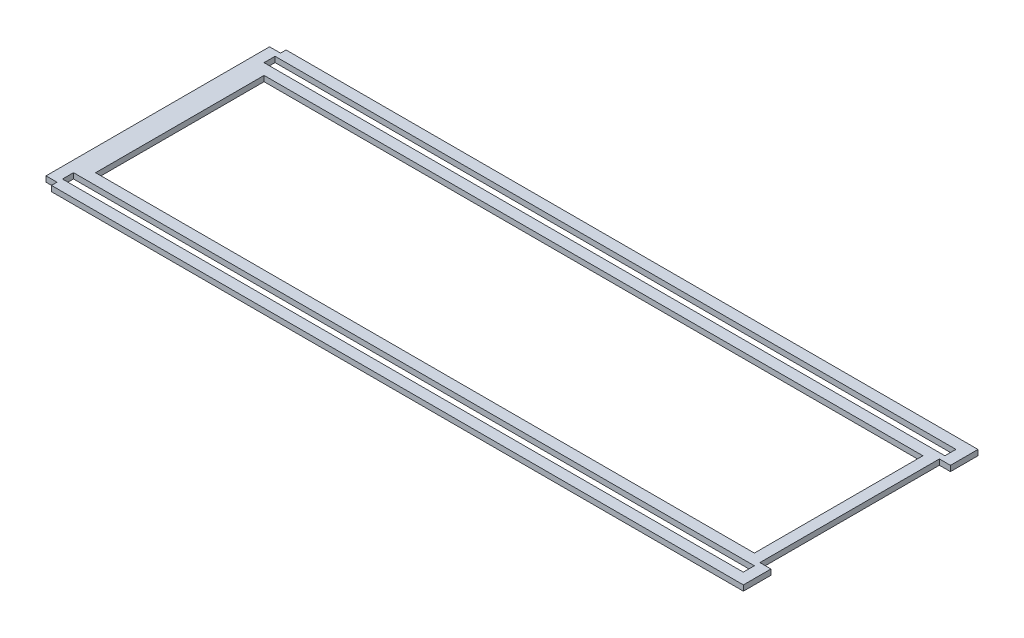
ISO-10303-21;
HEADER;
FILE_DESCRIPTION(('STEP AP214'),'2;1');
FILE_NAME('part.step','',(''),(''),'','','');
FILE_SCHEMA(('AUTOMOTIVE_DESIGN { 1 0 10303 214 1 1 1 1 }'));
ENDSEC;
DATA;
#1=APPLICATION_CONTEXT('core data for automotive mechanical design processes');
#2=APPLICATION_PROTOCOL_DEFINITION('international standard','automotive_design',2000,#1);
#3=PRODUCT_CONTEXT('',#1,'mechanical');
#4=PRODUCT('Part','Part','',(#3));
#5=PRODUCT_RELATED_PRODUCT_CATEGORY('part','',(#4));
#6=PRODUCT_DEFINITION_FORMATION('','',#4);
#7=PRODUCT_DEFINITION_CONTEXT('part definition',#1,'design');
#8=PRODUCT_DEFINITION('design','',#6,#7);
#9=PRODUCT_DEFINITION_SHAPE('','',#8);
#10=(LENGTH_UNIT() NAMED_UNIT(*) SI_UNIT(.MILLI.,.METRE.));
#11=(NAMED_UNIT(*) PLANE_ANGLE_UNIT() SI_UNIT($,.RADIAN.));
#12=(NAMED_UNIT(*) SI_UNIT($,.STERADIAN.) SOLID_ANGLE_UNIT());
#13=UNCERTAINTY_MEASURE_WITH_UNIT(LENGTH_MEASURE(1.E-05),#10,'distance_accuracy_value','');
#14=(GEOMETRIC_REPRESENTATION_CONTEXT(3) GLOBAL_UNCERTAINTY_ASSIGNED_CONTEXT((#13)) GLOBAL_UNIT_ASSIGNED_CONTEXT((#10,
#11,#12)) REPRESENTATION_CONTEXT('',''));
#15=CARTESIAN_POINT('',(0.,0.,0.));
#16=DIRECTION('',(0.,0.,1.));
#17=DIRECTION('',(1.,0.,0.));
#18=AXIS2_PLACEMENT_3D('',#15,#16,#17);
#19=CARTESIAN_POINT('',(0.,3.175,0.));
#20=DIRECTION('',(0.,1.,0.));
#21=DIRECTION('',(0.,0.,1.));
#22=AXIS2_PLACEMENT_3D('',#19,#20,#21);
#23=PLANE('',#22);
#24=DIRECTION('',(0.,0.,-1.));
#25=VECTOR('',#24,1.);
#26=CARTESIAN_POINT('',(203.2,3.175,51.895375));
#27=LINE('',#26,#25);
#28=CARTESIAN_POINT('',(203.2,3.175,67.821175));
#29=VERTEX_POINT('',#28);
#30=CARTESIAN_POINT('',(203.2,3.175,51.895375));
#31=VERTEX_POINT('',#30);
#32=EDGE_CURVE('E335',#29,#31,#27,.T.);
#33=ORIENTED_EDGE('',*,*,#32,.T.);
#34=DIRECTION('',(-1.,0.,0.));
#35=VECTOR('',#34,1.);
#36=CARTESIAN_POINT('',(203.2,3.175,51.895375));
#37=LINE('',#36,#35);
#38=CARTESIAN_POINT('',(196.7992,3.175,51.895375));
#39=VERTEX_POINT('',#38);
#40=EDGE_CURVE('E339',#31,#39,#37,.T.);
#41=ORIENTED_EDGE('',*,*,#40,.T.);
#42=DIRECTION('',(0.,0.,-1.));
#43=VECTOR('',#42,1.);
#44=CARTESIAN_POINT('',(196.7992,3.175,-51.895375));
#45=LINE('',#44,#43);
#46=CARTESIAN_POINT('',(196.7992,3.175,-51.895375));
#47=VERTEX_POINT('',#46);
#48=EDGE_CURVE('E343',#39,#47,#45,.T.);
#49=ORIENTED_EDGE('',*,*,#48,.T.);
#50=DIRECTION('',(1.,0.,0.));
#51=VECTOR('',#50,1.);
#52=CARTESIAN_POINT('',(203.2,3.175,-51.895375));
#53=LINE('',#52,#51);
#54=CARTESIAN_POINT('',(203.2,3.175,-51.895375));
#55=VERTEX_POINT('',#54);
#56=EDGE_CURVE('E346',#47,#55,#53,.T.);
#57=ORIENTED_EDGE('',*,*,#56,.T.);
#58=DIRECTION('',(0.,0.,-1.));
#59=VECTOR('',#58,1.);
#60=CARTESIAN_POINT('',(203.2,3.175,-67.821175));
#61=LINE('',#60,#59);
#62=CARTESIAN_POINT('',(203.2,3.175,-67.821175));
#63=VERTEX_POINT('',#62);
#64=EDGE_CURVE('E349',#55,#63,#61,.T.);
#65=ORIENTED_EDGE('',*,*,#64,.T.);
#66=DIRECTION('',(-1.,0.,0.));
#67=VECTOR('',#66,1.);
#68=CARTESIAN_POINT('',(-196.85,3.175,-67.821175));
#69=LINE('',#68,#67);
#70=CARTESIAN_POINT('',(-196.85,3.175,-67.821175));
#71=VERTEX_POINT('',#70);
#72=EDGE_CURVE('E352',#63,#71,#69,.T.);
#73=ORIENTED_EDGE('',*,*,#72,.T.);
#74=DIRECTION('',(0.,0.,1.));
#75=VECTOR('',#74,1.);
#76=CARTESIAN_POINT('',(-196.85,3.175,-64.620775));
#77=LINE('',#76,#75);
#78=CARTESIAN_POINT('',(-196.85,3.175,-64.620775));
#79=VERTEX_POINT('',#78);
#80=EDGE_CURVE('E355',#71,#79,#77,.T.);
#81=ORIENTED_EDGE('',*,*,#80,.T.);
#82=DIRECTION('',(-1.,0.,0.));
#83=VECTOR('',#82,1.);
#84=CARTESIAN_POINT('',(-203.2,3.175,-64.620775));
#85=LINE('',#84,#83);
#86=CARTESIAN_POINT('',(-203.2,3.175,-64.620775));
#87=VERTEX_POINT('',#86);
#88=EDGE_CURVE('E358',#79,#87,#85,.T.);
#89=ORIENTED_EDGE('',*,*,#88,.T.);
#90=DIRECTION('',(0.,0.,1.));
#91=VECTOR('',#90,1.);
#92=CARTESIAN_POINT('',(-203.2,3.175,-64.620775));
#93=LINE('',#92,#91);
#94=CARTESIAN_POINT('',(-203.2,3.175,64.620775));
#95=VERTEX_POINT('',#94);
#96=EDGE_CURVE('E361',#87,#95,#93,.T.);
#97=ORIENTED_EDGE('',*,*,#96,.T.);
#98=DIRECTION('',(1.,0.,0.));
#99=VECTOR('',#98,1.);
#100=CARTESIAN_POINT('',(-203.2,3.175,64.620775));
#101=LINE('',#100,#99);
#102=CARTESIAN_POINT('',(-196.85,3.175,64.620775));
#103=VERTEX_POINT('',#102);
#104=EDGE_CURVE('E364',#95,#103,#101,.T.);
#105=ORIENTED_EDGE('',*,*,#104,.T.);
#106=DIRECTION('',(0.,0.,1.));
#107=VECTOR('',#106,1.);
#108=CARTESIAN_POINT('',(-196.85,3.175,67.821175));
#109=LINE('',#108,#107);
#110=CARTESIAN_POINT('',(-196.85,3.175,67.821175));
#111=VERTEX_POINT('',#110);
#112=EDGE_CURVE('E367',#103,#111,#109,.T.);
#113=ORIENTED_EDGE('',*,*,#112,.T.);
#114=DIRECTION('',(1.,0.,0.));
#115=VECTOR('',#114,1.);
#116=CARTESIAN_POINT('',(-196.85,3.175,67.821175));
#117=LINE('',#116,#115);
#118=EDGE_CURVE('E370',#111,#29,#117,.T.);
#119=ORIENTED_EDGE('',*,*,#118,.T.);
#120=EDGE_LOOP('',(#33,#41,#49,#57,#65,#73,#81,#89,#97,#105,#113,#119));
#121=FACE_BOUND('',#120,.T.);
#122=DIRECTION('',(-1.,0.,0.));
#123=VECTOR('',#122,1.);
#124=CARTESIAN_POINT('',(-196.85,3.175,-61.471175));
#125=LINE('',#124,#123);
#126=CARTESIAN_POINT('',(196.7992,3.175,-61.471175));
#127=VERTEX_POINT('',#126);
#128=CARTESIAN_POINT('',(-196.85,3.175,-61.471175));
#129=VERTEX_POINT('',#128);
#130=EDGE_CURVE('E295',#127,#129,#125,.T.);
#131=ORIENTED_EDGE('',*,*,#130,.F.);
#132=DIRECTION('',(0.,0.,-1.));
#133=VECTOR('',#132,1.);
#134=CARTESIAN_POINT('',(196.7992,3.175,-61.471175));
#135=LINE('',#134,#133);
#136=CARTESIAN_POINT('',(196.7992,3.175,-55.070375));
#137=VERTEX_POINT('',#136);
#138=EDGE_CURVE('E292',#137,#127,#135,.T.);
#139=ORIENTED_EDGE('',*,*,#138,.F.);
#140=DIRECTION('',(1.,0.,0.));
#141=VECTOR('',#140,1.);
#142=CARTESIAN_POINT('',(-196.85,3.175,-55.070375));
#143=LINE('',#142,#141);
#144=CARTESIAN_POINT('',(-196.85,3.175,-55.070375));
#145=VERTEX_POINT('',#144);
#146=EDGE_CURVE('E303',#145,#137,#143,.T.);
#147=ORIENTED_EDGE('',*,*,#146,.F.);
#148=DIRECTION('',(0.,0.,1.));
#149=VECTOR('',#148,1.);
#150=CARTESIAN_POINT('',(-196.85,3.175,-55.070375));
#151=LINE('',#150,#149);
#152=EDGE_CURVE('E299',#129,#145,#151,.T.);
#153=ORIENTED_EDGE('',*,*,#152,.F.);
#154=EDGE_LOOP('',(#131,#139,#147,#153));
#155=FACE_BOUND('',#154,.T.);
#156=DIRECTION('',(-1.,0.,0.));
#157=VECTOR('',#156,1.);
#158=CARTESIAN_POINT('',(-196.85,3.175,55.070375));
#159=LINE('',#158,#157);
#160=CARTESIAN_POINT('',(196.7992,3.175,55.070375));
#161=VERTEX_POINT('',#160);
#162=CARTESIAN_POINT('',(-196.85,3.175,55.070375));
#163=VERTEX_POINT('',#162);
#164=EDGE_CURVE('E252',#161,#163,#159,.T.);
#165=ORIENTED_EDGE('',*,*,#164,.F.);
#166=DIRECTION('',(0.,0.,-1.));
#167=VECTOR('',#166,1.);
#168=CARTESIAN_POINT('',(196.7992,3.175,55.070375));
#169=LINE('',#168,#167);
#170=CARTESIAN_POINT('',(196.7992,3.175,61.471175));
#171=VERTEX_POINT('',#170);
#172=EDGE_CURVE('E249',#171,#161,#169,.T.);
#173=ORIENTED_EDGE('',*,*,#172,.F.);
#174=DIRECTION('',(1.,0.,0.));
#175=VECTOR('',#174,1.);
#176=CARTESIAN_POINT('',(-196.85,3.175,61.471175));
#177=LINE('',#176,#175);
#178=CARTESIAN_POINT('',(-196.85,3.175,61.471175));
#179=VERTEX_POINT('',#178);
#180=EDGE_CURVE('E260',#179,#171,#177,.T.);
#181=ORIENTED_EDGE('',*,*,#180,.F.);
#182=DIRECTION('',(0.,0.,1.));
#183=VECTOR('',#182,1.);
#184=CARTESIAN_POINT('',(-196.85,3.175,55.070375));
#185=LINE('',#184,#183);
#186=EDGE_CURVE('E256',#163,#179,#185,.T.);
#187=ORIENTED_EDGE('',*,*,#186,.F.);
#188=EDGE_LOOP('',(#165,#173,#181,#187));
#189=FACE_BOUND('',#188,.T.);
#190=DIRECTION('',(-1.,0.,0.));
#191=VECTOR('',#190,1.);
#192=CARTESIAN_POINT('',(-190.4492,3.175,-48.720375));
#193=LINE('',#192,#191);
#194=CARTESIAN_POINT('',(190.4492,3.175,-48.720375));
#195=VERTEX_POINT('',#194);
#196=CARTESIAN_POINT('',(-190.4492,3.175,-48.720375));
#197=VERTEX_POINT('',#196);
#198=EDGE_CURVE('E210',#195,#197,#193,.T.);
#199=ORIENTED_EDGE('',*,*,#198,.F.);
#200=DIRECTION('',(0.,0.,-1.));
#201=VECTOR('',#200,1.);
#202=CARTESIAN_POINT('',(190.4492,3.175,-48.720375));
#203=LINE('',#202,#201);
#204=CARTESIAN_POINT('',(190.4492,3.175,48.720375));
#205=VERTEX_POINT('',#204);
#206=EDGE_CURVE('E201',#205,#195,#203,.T.);
#207=ORIENTED_EDGE('',*,*,#206,.F.);
#208=DIRECTION('',(1.,0.,0.));
#209=VECTOR('',#208,1.);
#210=CARTESIAN_POINT('',(-190.4492,3.175,48.720375));
#211=LINE('',#210,#209);
#212=CARTESIAN_POINT('',(-190.4492,3.175,48.720375));
#213=VERTEX_POINT('',#212);
#214=EDGE_CURVE('E227',#213,#205,#211,.T.);
#215=ORIENTED_EDGE('',*,*,#214,.F.);
#216=DIRECTION('',(0.,0.,1.));
#217=VECTOR('',#216,1.);
#218=CARTESIAN_POINT('',(-190.4492,3.175,-48.720375));
#219=LINE('',#218,#217);
#220=EDGE_CURVE('E223',#197,#213,#219,.T.);
#221=ORIENTED_EDGE('',*,*,#220,.F.);
#222=EDGE_LOOP('',(#199,#207,#215,#221));
#223=FACE_BOUND('',#222,.T.);
#224=ADVANCED_FACE('F39',(#121,#155,#189,#223),#23,.T.);
#225=CARTESIAN_POINT('',(0.,0.,0.));
#226=DIRECTION('',(0.,1.,0.));
#227=DIRECTION('',(0.,0.,1.));
#228=AXIS2_PLACEMENT_3D('',#225,#226,#227);
#229=PLANE('',#228);
#230=DIRECTION('',(0.,0.,-1.));
#231=VECTOR('',#230,1.);
#232=CARTESIAN_POINT('',(196.7992,0.,55.070375));
#233=LINE('',#232,#231);
#234=CARTESIAN_POINT('',(196.7992,0.,61.471175));
#235=VERTEX_POINT('',#234);
#236=CARTESIAN_POINT('',(196.7992,0.,55.070375));
#237=VERTEX_POINT('',#236);
#238=EDGE_CURVE('E219',#235,#237,#233,.T.);
#239=ORIENTED_EDGE('',*,*,#238,.T.);
#240=DIRECTION('',(-1.,0.,0.));
#241=VECTOR('',#240,1.);
#242=CARTESIAN_POINT('',(-196.85,0.,55.070375));
#243=LINE('',#242,#241);
#244=CARTESIAN_POINT('',(-196.85,0.,55.070375));
#245=VERTEX_POINT('',#244);
#246=EDGE_CURVE('E267',#237,#245,#243,.T.);
#247=ORIENTED_EDGE('',*,*,#246,.T.);
#248=DIRECTION('',(0.,0.,1.));
#249=VECTOR('',#248,1.);
#250=CARTESIAN_POINT('',(-196.85,0.,55.070375));
#251=LINE('',#250,#249);
#252=CARTESIAN_POINT('',(-196.85,0.,61.471175));
#253=VERTEX_POINT('',#252);
#254=EDGE_CURVE('E271',#245,#253,#251,.T.);
#255=ORIENTED_EDGE('',*,*,#254,.T.);
#256=DIRECTION('',(1.,0.,0.));
#257=VECTOR('',#256,1.);
#258=CARTESIAN_POINT('',(-196.85,0.,61.471175));
#259=LINE('',#258,#257);
#260=EDGE_CURVE('E253',#253,#235,#259,.T.);
#261=ORIENTED_EDGE('',*,*,#260,.T.);
#262=EDGE_LOOP('',(#239,#247,#255,#261));
#263=FACE_BOUND('',#262,.T.);
#264=DIRECTION('',(0.,0.,-1.));
#265=VECTOR('',#264,1.);
#266=CARTESIAN_POINT('',(203.2,0.,51.895375));
#267=LINE('',#266,#265);
#268=CARTESIAN_POINT('',(203.2,0.,67.821175));
#269=VERTEX_POINT('',#268);
#270=CARTESIAN_POINT('',(203.2,0.,51.895375));
#271=VERTEX_POINT('',#270);
#272=EDGE_CURVE('E334',#269,#271,#267,.T.);
#273=ORIENTED_EDGE('',*,*,#272,.F.);
#274=DIRECTION('',(1.,0.,0.));
#275=VECTOR('',#274,1.);
#276=CARTESIAN_POINT('',(-196.85,0.,67.821175));
#277=LINE('',#276,#275);
#278=CARTESIAN_POINT('',(-196.85,0.,67.821175));
#279=VERTEX_POINT('',#278);
#280=EDGE_CURVE('E340',#279,#269,#277,.T.);
#281=ORIENTED_EDGE('',*,*,#280,.F.);
#282=DIRECTION('',(0.,0.,1.));
#283=VECTOR('',#282,1.);
#284=CARTESIAN_POINT('',(-196.85,0.,67.821175));
#285=LINE('',#284,#283);
#286=CARTESIAN_POINT('',(-196.85,0.,64.620775));
#287=VERTEX_POINT('',#286);
#288=EDGE_CURVE('E404',#287,#279,#285,.T.);
#289=ORIENTED_EDGE('',*,*,#288,.F.);
#290=DIRECTION('',(1.,0.,0.));
#291=VECTOR('',#290,1.);
#292=CARTESIAN_POINT('',(-203.2,0.,64.620775));
#293=LINE('',#292,#291);
#294=CARTESIAN_POINT('',(-203.2,0.,64.620775));
#295=VERTEX_POINT('',#294);
#296=EDGE_CURVE('E401',#295,#287,#293,.T.);
#297=ORIENTED_EDGE('',*,*,#296,.F.);
#298=DIRECTION('',(0.,0.,1.));
#299=VECTOR('',#298,1.);
#300=CARTESIAN_POINT('',(-203.2,0.,-64.620775));
#301=LINE('',#300,#299);
#302=CARTESIAN_POINT('',(-203.2,0.,-64.620775));
#303=VERTEX_POINT('',#302);
#304=EDGE_CURVE('E398',#303,#295,#301,.T.);
#305=ORIENTED_EDGE('',*,*,#304,.F.);
#306=DIRECTION('',(-1.,0.,0.));
#307=VECTOR('',#306,1.);
#308=CARTESIAN_POINT('',(-203.2,0.,-64.620775));
#309=LINE('',#308,#307);
#310=CARTESIAN_POINT('',(-196.85,0.,-64.620775));
#311=VERTEX_POINT('',#310);
#312=EDGE_CURVE('E395',#311,#303,#309,.T.);
#313=ORIENTED_EDGE('',*,*,#312,.F.);
#314=DIRECTION('',(0.,0.,1.));
#315=VECTOR('',#314,1.);
#316=CARTESIAN_POINT('',(-196.85,0.,-64.620775));
#317=LINE('',#316,#315);
#318=CARTESIAN_POINT('',(-196.85,0.,-67.821175));
#319=VERTEX_POINT('',#318);
#320=EDGE_CURVE('E392',#319,#311,#317,.T.);
#321=ORIENTED_EDGE('',*,*,#320,.F.);
#322=DIRECTION('',(-1.,0.,0.));
#323=VECTOR('',#322,1.);
#324=CARTESIAN_POINT('',(-196.85,0.,-67.821175));
#325=LINE('',#324,#323);
#326=CARTESIAN_POINT('',(203.2,0.,-67.821175));
#327=VERTEX_POINT('',#326);
#328=EDGE_CURVE('E389',#327,#319,#325,.T.);
#329=ORIENTED_EDGE('',*,*,#328,.F.);
#330=DIRECTION('',(0.,0.,-1.));
#331=VECTOR('',#330,1.);
#332=CARTESIAN_POINT('',(203.2,0.,-67.821175));
#333=LINE('',#332,#331);
#334=CARTESIAN_POINT('',(203.2,0.,-51.895375));
#335=VERTEX_POINT('',#334);
#336=EDGE_CURVE('E386',#335,#327,#333,.T.);
#337=ORIENTED_EDGE('',*,*,#336,.F.);
#338=DIRECTION('',(1.,0.,0.));
#339=VECTOR('',#338,1.);
#340=CARTESIAN_POINT('',(203.2,0.,-51.895375));
#341=LINE('',#340,#339);
#342=CARTESIAN_POINT('',(196.7992,0.,-51.895375));
#343=VERTEX_POINT('',#342);
#344=EDGE_CURVE('E383',#343,#335,#341,.T.);
#345=ORIENTED_EDGE('',*,*,#344,.F.);
#346=DIRECTION('',(0.,0.,-1.));
#347=VECTOR('',#346,1.);
#348=CARTESIAN_POINT('',(196.7992,0.,-51.895375));
#349=LINE('',#348,#347);
#350=CARTESIAN_POINT('',(196.7992,0.,51.895375));
#351=VERTEX_POINT('',#350);
#352=EDGE_CURVE('E380',#351,#343,#349,.T.);
#353=ORIENTED_EDGE('',*,*,#352,.F.);
#354=DIRECTION('',(-1.,0.,0.));
#355=VECTOR('',#354,1.);
#356=CARTESIAN_POINT('',(203.2,0.,51.895375));
#357=LINE('',#356,#355);
#358=EDGE_CURVE('E377',#271,#351,#357,.T.);
#359=ORIENTED_EDGE('',*,*,#358,.F.);
#360=EDGE_LOOP('',(#273,#281,#289,#297,#305,#313,#321,#329,#337,#345,#353,#359));
#361=FACE_BOUND('',#360,.T.);
#362=DIRECTION('',(0.,0.,-1.));
#363=VECTOR('',#362,1.);
#364=CARTESIAN_POINT('',(196.7992,0.,-61.471175));
#365=LINE('',#364,#363);
#366=CARTESIAN_POINT('',(196.7992,0.,-55.070375));
#367=VERTEX_POINT('',#366);
#368=CARTESIAN_POINT('',(196.7992,0.,-61.471175));
#369=VERTEX_POINT('',#368);
#370=EDGE_CURVE('E291',#367,#369,#365,.T.);
#371=ORIENTED_EDGE('',*,*,#370,.T.);
#372=DIRECTION('',(-1.,0.,0.));
#373=VECTOR('',#372,1.);
#374=CARTESIAN_POINT('',(-196.85,0.,-61.471175));
#375=LINE('',#374,#373);
#376=CARTESIAN_POINT('',(-196.85,0.,-61.471175));
#377=VERTEX_POINT('',#376);
#378=EDGE_CURVE('E310',#369,#377,#375,.T.);
#379=ORIENTED_EDGE('',*,*,#378,.T.);
#380=DIRECTION('',(0.,0.,1.));
#381=VECTOR('',#380,1.);
#382=CARTESIAN_POINT('',(-196.85,0.,-55.070375));
#383=LINE('',#382,#381);
#384=CARTESIAN_POINT('',(-196.85,0.,-55.070375));
#385=VERTEX_POINT('',#384);
#386=EDGE_CURVE('E314',#377,#385,#383,.T.);
#387=ORIENTED_EDGE('',*,*,#386,.T.);
#388=DIRECTION('',(1.,0.,0.));
#389=VECTOR('',#388,1.);
#390=CARTESIAN_POINT('',(-196.85,0.,-55.070375));
#391=LINE('',#390,#389);
#392=EDGE_CURVE('E296',#385,#367,#391,.T.);
#393=ORIENTED_EDGE('',*,*,#392,.T.);
#394=EDGE_LOOP('',(#371,#379,#387,#393));
#395=FACE_BOUND('',#394,.T.);
#396=DIRECTION('',(0.,0.,-1.));
#397=VECTOR('',#396,1.);
#398=CARTESIAN_POINT('',(190.4492,0.,-48.720375));
#399=LINE('',#398,#397);
#400=CARTESIAN_POINT('',(190.4492,0.,48.720375));
#401=VERTEX_POINT('',#400);
#402=CARTESIAN_POINT('',(190.4492,0.,-48.720375));
#403=VERTEX_POINT('',#402);
#404=EDGE_CURVE('E63',#401,#403,#399,.T.);
#405=ORIENTED_EDGE('',*,*,#404,.T.);
#406=DIRECTION('',(-1.,0.,0.));
#407=VECTOR('',#406,1.);
#408=CARTESIAN_POINT('',(-190.4492,0.,-48.720375));
#409=LINE('',#408,#407);
#410=CARTESIAN_POINT('',(-190.4492,0.,-48.720375));
#411=VERTEX_POINT('',#410);
#412=EDGE_CURVE('E217',#403,#411,#409,.T.);
#413=ORIENTED_EDGE('',*,*,#412,.T.);
#414=DIRECTION('',(0.,0.,1.));
#415=VECTOR('',#414,1.);
#416=CARTESIAN_POINT('',(-190.4492,0.,-48.720375));
#417=LINE('',#416,#415);
#418=CARTESIAN_POINT('',(-190.4492,0.,48.720375));
#419=VERTEX_POINT('',#418);
#420=EDGE_CURVE('E236',#411,#419,#417,.T.);
#421=ORIENTED_EDGE('',*,*,#420,.T.);
#422=DIRECTION('',(1.,0.,0.));
#423=VECTOR('',#422,1.);
#424=CARTESIAN_POINT('',(-190.4492,0.,48.720375));
#425=LINE('',#424,#423);
#426=EDGE_CURVE('E211',#419,#401,#425,.T.);
#427=ORIENTED_EDGE('',*,*,#426,.T.);
#428=EDGE_LOOP('',(#405,#413,#421,#427));
#429=FACE_BOUND('',#428,.T.);
#430=ADVANCED_FACE('F459',(#263,#361,#395,#429),#229,.F.);
#431=CARTESIAN_POINT('',(203.2,3.175,51.895375));
#432=DIRECTION('',(-1.,0.,0.));
#433=DIRECTION('',(0.,0.,1.));
#434=AXIS2_PLACEMENT_3D('',#431,#432,#433);
#435=PLANE('',#434);
#436=ORIENTED_EDGE('',*,*,#272,.T.);
#437=DIRECTION('',(0.,-1.,0.));
#438=VECTOR('',#437,1.);
#439=CARTESIAN_POINT('',(203.2,3.175,51.895375));
#440=LINE('',#439,#438);
#441=EDGE_CURVE('E11',#31,#271,#440,.T.);
#442=ORIENTED_EDGE('',*,*,#441,.F.);
#443=ORIENTED_EDGE('',*,*,#32,.F.);
#444=DIRECTION('',(0.,-1.,0.));
#445=VECTOR('',#444,1.);
#446=CARTESIAN_POINT('',(203.2,3.175,67.821175));
#447=LINE('',#446,#445);
#448=EDGE_CURVE('E373',#29,#269,#447,.T.);
#449=ORIENTED_EDGE('',*,*,#448,.T.);
#450=EDGE_LOOP('',(#436,#442,#443,#449));
#451=FACE_BOUND('',#450,.T.);
#452=ADVANCED_FACE('F41',(#451),#435,.F.);
#453=CARTESIAN_POINT('',(203.2,3.175,51.895375));
#454=DIRECTION('',(0.,0.,1.));
#455=DIRECTION('',(1.,0.,0.));
#456=AXIS2_PLACEMENT_3D('',#453,#454,#455);
#457=PLANE('',#456);
#458=ORIENTED_EDGE('',*,*,#358,.T.);
#459=DIRECTION('',(0.,-1.,0.));
#460=VECTOR('',#459,1.);
#461=CARTESIAN_POINT('',(196.7992,3.175,51.895375));
#462=LINE('',#461,#460);
#463=EDGE_CURVE('E48',#39,#351,#462,.T.);
#464=ORIENTED_EDGE('',*,*,#463,.F.);
#465=ORIENTED_EDGE('',*,*,#40,.F.);
#466=ORIENTED_EDGE('',*,*,#441,.T.);
#467=EDGE_LOOP('',(#458,#464,#465,#466));
#468=FACE_BOUND('',#467,.T.);
#469=ADVANCED_FACE('F477',(#468),#457,.F.);
#470=CARTESIAN_POINT('',(196.7992,3.175,-51.895375));
#471=DIRECTION('',(-1.,0.,0.));
#472=DIRECTION('',(0.,0.,1.));
#473=AXIS2_PLACEMENT_3D('',#470,#471,#472);
#474=PLANE('',#473);
#475=ORIENTED_EDGE('',*,*,#352,.T.);
#476=DIRECTION('',(0.,-1.,0.));
#477=VECTOR('',#476,1.);
#478=CARTESIAN_POINT('',(196.7992,3.175,-51.895375));
#479=LINE('',#478,#477);
#480=EDGE_CURVE('E444',#47,#343,#479,.T.);
#481=ORIENTED_EDGE('',*,*,#480,.F.);
#482=ORIENTED_EDGE('',*,*,#48,.F.);
#483=ORIENTED_EDGE('',*,*,#463,.T.);
#484=EDGE_LOOP('',(#475,#481,#482,#483));
#485=FACE_BOUND('',#484,.T.);
#486=ADVANCED_FACE('F453',(#485),#474,.F.);
#487=CARTESIAN_POINT('',(203.2,3.175,-51.895375));
#488=DIRECTION('',(0.,0.,-1.));
#489=DIRECTION('',(-1.,0.,0.));
#490=AXIS2_PLACEMENT_3D('',#487,#488,#489);
#491=PLANE('',#490);
#492=ORIENTED_EDGE('',*,*,#344,.T.);
#493=DIRECTION('',(0.,-1.,0.));
#494=VECTOR('',#493,1.);
#495=CARTESIAN_POINT('',(203.2,3.175,-51.895375));
#496=LINE('',#495,#494);
#497=EDGE_CURVE('E440',#55,#335,#496,.T.);
#498=ORIENTED_EDGE('',*,*,#497,.F.);
#499=ORIENTED_EDGE('',*,*,#56,.F.);
#500=ORIENTED_EDGE('',*,*,#480,.T.);
#501=EDGE_LOOP('',(#492,#498,#499,#500));
#502=FACE_BOUND('',#501,.T.);
#503=ADVANCED_FACE('F465',(#502),#491,.F.);
#504=CARTESIAN_POINT('',(203.2,3.175,-67.821175));
#505=DIRECTION('',(-1.,0.,0.));
#506=DIRECTION('',(0.,0.,1.));
#507=AXIS2_PLACEMENT_3D('',#504,#505,#506);
#508=PLANE('',#507);
#509=ORIENTED_EDGE('',*,*,#336,.T.);
#510=DIRECTION('',(0.,-1.,0.));
#511=VECTOR('',#510,1.);
#512=CARTESIAN_POINT('',(203.2,3.175,-67.821175));
#513=LINE('',#512,#511);
#514=EDGE_CURVE('E436',#63,#327,#513,.T.);
#515=ORIENTED_EDGE('',*,*,#514,.F.);
#516=ORIENTED_EDGE('',*,*,#64,.F.);
#517=ORIENTED_EDGE('',*,*,#497,.T.);
#518=EDGE_LOOP('',(#509,#515,#516,#517));
#519=FACE_BOUND('',#518,.T.);
#520=ADVANCED_FACE('F469',(#519),#508,.F.);
#521=CARTESIAN_POINT('',(-196.85,3.175,-67.821175));
#522=DIRECTION('',(0.,0.,1.));
#523=DIRECTION('',(1.,0.,0.));
#524=AXIS2_PLACEMENT_3D('',#521,#522,#523);
#525=PLANE('',#524);
#526=ORIENTED_EDGE('',*,*,#328,.T.);
#527=DIRECTION('',(0.,-1.,0.));
#528=VECTOR('',#527,1.);
#529=CARTESIAN_POINT('',(-196.85,3.175,-67.821175));
#530=LINE('',#529,#528);
#531=EDGE_CURVE('E432',#71,#319,#530,.T.);
#532=ORIENTED_EDGE('',*,*,#531,.F.);
#533=ORIENTED_EDGE('',*,*,#72,.F.);
#534=ORIENTED_EDGE('',*,*,#514,.T.);
#535=EDGE_LOOP('',(#526,#532,#533,#534));
#536=FACE_BOUND('',#535,.T.);
#537=ADVANCED_FACE('F510',(#536),#525,.F.);
#538=CARTESIAN_POINT('',(-196.85,3.175,-64.620775));
#539=DIRECTION('',(1.,0.,0.));
#540=DIRECTION('',(0.,0.,-1.));
#541=AXIS2_PLACEMENT_3D('',#538,#539,#540);
#542=PLANE('',#541);
#543=ORIENTED_EDGE('',*,*,#320,.T.);
#544=DIRECTION('',(0.,-1.,0.));
#545=VECTOR('',#544,1.);
#546=CARTESIAN_POINT('',(-196.85,3.175,-64.620775));
#547=LINE('',#546,#545);
#548=EDGE_CURVE('E428',#79,#311,#547,.T.);
#549=ORIENTED_EDGE('',*,*,#548,.F.);
#550=ORIENTED_EDGE('',*,*,#80,.F.);
#551=ORIENTED_EDGE('',*,*,#531,.T.);
#552=EDGE_LOOP('',(#543,#549,#550,#551));
#553=FACE_BOUND('',#552,.T.);
#554=ADVANCED_FACE('F508',(#553),#542,.F.);
#555=CARTESIAN_POINT('',(-203.2,3.175,-64.620775));
#556=DIRECTION('',(0.,0.,1.));
#557=DIRECTION('',(1.,0.,0.));
#558=AXIS2_PLACEMENT_3D('',#555,#556,#557);
#559=PLANE('',#558);
#560=ORIENTED_EDGE('',*,*,#312,.T.);
#561=DIRECTION('',(0.,-1.,0.));
#562=VECTOR('',#561,1.);
#563=CARTESIAN_POINT('',(-203.2,3.175,-64.620775));
#564=LINE('',#563,#562);
#565=EDGE_CURVE('E424',#87,#303,#564,.T.);
#566=ORIENTED_EDGE('',*,*,#565,.F.);
#567=ORIENTED_EDGE('',*,*,#88,.F.);
#568=ORIENTED_EDGE('',*,*,#548,.T.);
#569=EDGE_LOOP('',(#560,#566,#567,#568));
#570=FACE_BOUND('',#569,.T.);
#571=ADVANCED_FACE('F504',(#570),#559,.F.);
#572=CARTESIAN_POINT('',(-203.2,3.175,-64.620775));
#573=DIRECTION('',(1.,0.,0.));
#574=DIRECTION('',(0.,0.,-1.));
#575=AXIS2_PLACEMENT_3D('',#572,#573,#574);
#576=PLANE('',#575);
#577=ORIENTED_EDGE('',*,*,#304,.T.);
#578=DIRECTION('',(0.,-1.,0.));
#579=VECTOR('',#578,1.);
#580=CARTESIAN_POINT('',(-203.2,3.175,64.620775));
#581=LINE('',#580,#579);
#582=EDGE_CURVE('E420',#95,#295,#581,.T.);
#583=ORIENTED_EDGE('',*,*,#582,.F.);
#584=ORIENTED_EDGE('',*,*,#96,.F.);
#585=ORIENTED_EDGE('',*,*,#565,.T.);
#586=EDGE_LOOP('',(#577,#583,#584,#585));
#587=FACE_BOUND('',#586,.T.);
#588=ADVANCED_FACE('F499',(#587),#576,.F.);
#589=CARTESIAN_POINT('',(-203.2,3.175,64.620775));
#590=DIRECTION('',(0.,0.,-1.));
#591=DIRECTION('',(-1.,0.,0.));
#592=AXIS2_PLACEMENT_3D('',#589,#590,#591);
#593=PLANE('',#592);
#594=ORIENTED_EDGE('',*,*,#296,.T.);
#595=DIRECTION('',(0.,-1.,0.));
#596=VECTOR('',#595,1.);
#597=CARTESIAN_POINT('',(-196.85,3.175,64.620775));
#598=LINE('',#597,#596);
#599=EDGE_CURVE('E416',#103,#287,#598,.T.);
#600=ORIENTED_EDGE('',*,*,#599,.F.);
#601=ORIENTED_EDGE('',*,*,#104,.F.);
#602=ORIENTED_EDGE('',*,*,#582,.T.);
#603=EDGE_LOOP('',(#594,#600,#601,#602));
#604=FACE_BOUND('',#603,.T.);
#605=ADVANCED_FACE('F493',(#604),#593,.F.);
#606=CARTESIAN_POINT('',(-196.85,3.175,67.821175));
#607=DIRECTION('',(1.,0.,0.));
#608=DIRECTION('',(0.,0.,-1.));
#609=AXIS2_PLACEMENT_3D('',#606,#607,#608);
#610=PLANE('',#609);
#611=ORIENTED_EDGE('',*,*,#288,.T.);
#612=DIRECTION('',(0.,-1.,0.));
#613=VECTOR('',#612,1.);
#614=CARTESIAN_POINT('',(-196.85,3.175,67.821175));
#615=LINE('',#614,#613);
#616=EDGE_CURVE('E412',#111,#279,#615,.T.);
#617=ORIENTED_EDGE('',*,*,#616,.F.);
#618=ORIENTED_EDGE('',*,*,#112,.F.);
#619=ORIENTED_EDGE('',*,*,#599,.T.);
#620=EDGE_LOOP('',(#611,#617,#618,#619));
#621=FACE_BOUND('',#620,.T.);
#622=ADVANCED_FACE('F489',(#621),#610,.F.);
#623=CARTESIAN_POINT('',(-196.85,3.175,67.821175));
#624=DIRECTION('',(0.,0.,-1.));
#625=DIRECTION('',(-1.,0.,0.));
#626=AXIS2_PLACEMENT_3D('',#623,#624,#625);
#627=PLANE('',#626);
#628=ORIENTED_EDGE('',*,*,#280,.T.);
#629=ORIENTED_EDGE('',*,*,#448,.F.);
#630=ORIENTED_EDGE('',*,*,#118,.F.);
#631=ORIENTED_EDGE('',*,*,#616,.T.);
#632=EDGE_LOOP('',(#628,#629,#630,#631));
#633=FACE_BOUND('',#632,.T.);
#634=ADVANCED_FACE('F484',(#633),#627,.F.);
#635=CARTESIAN_POINT('',(196.7992,3.175,-61.471175));
#636=DIRECTION('',(-1.,0.,0.));
#637=DIRECTION('',(0.,0.,1.));
#638=AXIS2_PLACEMENT_3D('',#635,#636,#637);
#639=PLANE('',#638);
#640=ORIENTED_EDGE('',*,*,#370,.F.);
#641=DIRECTION('',(0.,-1.,0.));
#642=VECTOR('',#641,1.);
#643=CARTESIAN_POINT('',(196.7992,3.175,-55.070375));
#644=LINE('',#643,#642);
#645=EDGE_CURVE('E306',#137,#367,#644,.T.);
#646=ORIENTED_EDGE('',*,*,#645,.F.);
#647=ORIENTED_EDGE('',*,*,#138,.T.);
#648=DIRECTION('',(0.,-1.,0.));
#649=VECTOR('',#648,1.);
#650=CARTESIAN_POINT('',(196.7992,3.175,-61.471175));
#651=LINE('',#650,#649);
#652=EDGE_CURVE('E330',#127,#369,#651,.T.);
#653=ORIENTED_EDGE('',*,*,#652,.T.);
#654=EDGE_LOOP('',(#640,#646,#647,#653));
#655=FACE_BOUND('',#654,.T.);
#656=ADVANCED_FACE('F527',(#655),#639,.T.);
#657=CARTESIAN_POINT('',(-196.85,3.175,-61.471175));
#658=DIRECTION('',(0.,0.,1.));
#659=DIRECTION('',(1.,0.,0.));
#660=AXIS2_PLACEMENT_3D('',#657,#658,#659);
#661=PLANE('',#660);
#662=ORIENTED_EDGE('',*,*,#378,.F.);
#663=ORIENTED_EDGE('',*,*,#652,.F.);
#664=ORIENTED_EDGE('',*,*,#130,.T.);
#665=DIRECTION('',(0.,-1.,0.));
#666=VECTOR('',#665,1.);
#667=CARTESIAN_POINT('',(-196.85,3.175,-61.471175));
#668=LINE('',#667,#666);
#669=EDGE_CURVE('E327',#129,#377,#668,.T.);
#670=ORIENTED_EDGE('',*,*,#669,.T.);
#671=EDGE_LOOP('',(#662,#663,#664,#670));
#672=FACE_BOUND('',#671,.T.);
#673=ADVANCED_FACE('F565',(#672),#661,.T.);
#674=CARTESIAN_POINT('',(-196.85,3.175,-55.070375));
#675=DIRECTION('',(1.,0.,0.));
#676=DIRECTION('',(0.,0.,-1.));
#677=AXIS2_PLACEMENT_3D('',#674,#675,#676);
#678=PLANE('',#677);
#679=ORIENTED_EDGE('',*,*,#386,.F.);
#680=ORIENTED_EDGE('',*,*,#669,.F.);
#681=ORIENTED_EDGE('',*,*,#152,.T.);
#682=DIRECTION('',(0.,-1.,0.));
#683=VECTOR('',#682,1.);
#684=CARTESIAN_POINT('',(-196.85,3.175,-55.070375));
#685=LINE('',#684,#683);
#686=EDGE_CURVE('E324',#145,#385,#685,.T.);
#687=ORIENTED_EDGE('',*,*,#686,.T.);
#688=EDGE_LOOP('',(#679,#680,#681,#687));
#689=FACE_BOUND('',#688,.T.);
#690=ADVANCED_FACE('F572',(#689),#678,.T.);
#691=CARTESIAN_POINT('',(-196.85,3.175,-55.070375));
#692=DIRECTION('',(0.,0.,-1.));
#693=DIRECTION('',(-1.,0.,0.));
#694=AXIS2_PLACEMENT_3D('',#691,#692,#693);
#695=PLANE('',#694);
#696=ORIENTED_EDGE('',*,*,#392,.F.);
#697=ORIENTED_EDGE('',*,*,#686,.F.);
#698=ORIENTED_EDGE('',*,*,#146,.T.);
#699=ORIENTED_EDGE('',*,*,#645,.T.);
#700=EDGE_LOOP('',(#696,#697,#698,#699));
#701=FACE_BOUND('',#700,.T.);
#702=ADVANCED_FACE('F579',(#701),#695,.T.);
#703=CARTESIAN_POINT('',(196.7992,3.175,55.070375));
#704=DIRECTION('',(-1.,0.,0.));
#705=DIRECTION('',(0.,0.,1.));
#706=AXIS2_PLACEMENT_3D('',#703,#704,#705);
#707=PLANE('',#706);
#708=ORIENTED_EDGE('',*,*,#238,.F.);
#709=DIRECTION('',(0.,-1.,0.));
#710=VECTOR('',#709,1.);
#711=CARTESIAN_POINT('',(196.7992,3.175,61.471175));
#712=LINE('',#711,#710);
#713=EDGE_CURVE('E263',#171,#235,#712,.T.);
#714=ORIENTED_EDGE('',*,*,#713,.F.);
#715=ORIENTED_EDGE('',*,*,#172,.T.);
#716=DIRECTION('',(0.,-1.,0.));
#717=VECTOR('',#716,1.);
#718=CARTESIAN_POINT('',(196.7992,3.175,55.070375));
#719=LINE('',#718,#717);
#720=EDGE_CURVE('E287',#161,#237,#719,.T.);
#721=ORIENTED_EDGE('',*,*,#720,.T.);
#722=EDGE_LOOP('',(#708,#714,#715,#721));
#723=FACE_BOUND('',#722,.T.);
#724=ADVANCED_FACE('F587',(#723),#707,.T.);
#725=CARTESIAN_POINT('',(-196.85,3.175,55.070375));
#726=DIRECTION('',(0.,0.,1.));
#727=DIRECTION('',(1.,0.,0.));
#728=AXIS2_PLACEMENT_3D('',#725,#726,#727);
#729=PLANE('',#728);
#730=ORIENTED_EDGE('',*,*,#246,.F.);
#731=ORIENTED_EDGE('',*,*,#720,.F.);
#732=ORIENTED_EDGE('',*,*,#164,.T.);
#733=DIRECTION('',(0.,-1.,0.));
#734=VECTOR('',#733,1.);
#735=CARTESIAN_POINT('',(-196.85,3.175,55.070375));
#736=LINE('',#735,#734);
#737=EDGE_CURVE('E284',#163,#245,#736,.T.);
#738=ORIENTED_EDGE('',*,*,#737,.T.);
#739=EDGE_LOOP('',(#730,#731,#732,#738));
#740=FACE_BOUND('',#739,.T.);
#741=ADVANCED_FACE('F595',(#740),#729,.T.);
#742=CARTESIAN_POINT('',(-196.85,3.175,55.070375));
#743=DIRECTION('',(1.,0.,0.));
#744=DIRECTION('',(0.,0.,-1.));
#745=AXIS2_PLACEMENT_3D('',#742,#743,#744);
#746=PLANE('',#745);
#747=ORIENTED_EDGE('',*,*,#254,.F.);
#748=ORIENTED_EDGE('',*,*,#737,.F.);
#749=ORIENTED_EDGE('',*,*,#186,.T.);
#750=DIRECTION('',(0.,-1.,0.));
#751=VECTOR('',#750,1.);
#752=CARTESIAN_POINT('',(-196.85,3.175,61.471175));
#753=LINE('',#752,#751);
#754=EDGE_CURVE('E281',#179,#253,#753,.T.);
#755=ORIENTED_EDGE('',*,*,#754,.T.);
#756=EDGE_LOOP('',(#747,#748,#749,#755));
#757=FACE_BOUND('',#756,.T.);
#758=ADVANCED_FACE('F603',(#757),#746,.T.);
#759=CARTESIAN_POINT('',(-196.85,3.175,61.471175));
#760=DIRECTION('',(0.,0.,-1.));
#761=DIRECTION('',(-1.,0.,0.));
#762=AXIS2_PLACEMENT_3D('',#759,#760,#761);
#763=PLANE('',#762);
#764=ORIENTED_EDGE('',*,*,#260,.F.);
#765=ORIENTED_EDGE('',*,*,#754,.F.);
#766=ORIENTED_EDGE('',*,*,#180,.T.);
#767=ORIENTED_EDGE('',*,*,#713,.T.);
#768=EDGE_LOOP('',(#764,#765,#766,#767));
#769=FACE_BOUND('',#768,.T.);
#770=ADVANCED_FACE('F611',(#769),#763,.T.);
#771=CARTESIAN_POINT('',(190.4492,3.175,-48.720375));
#772=DIRECTION('',(-1.,0.,0.));
#773=DIRECTION('',(0.,0.,1.));
#774=AXIS2_PLACEMENT_3D('',#771,#772,#773);
#775=PLANE('',#774);
#776=ORIENTED_EDGE('',*,*,#404,.F.);
#777=DIRECTION('',(0.,-1.,0.));
#778=VECTOR('',#777,1.);
#779=CARTESIAN_POINT('',(190.4492,3.175,48.720375));
#780=LINE('',#779,#778);
#781=EDGE_CURVE('E205',#205,#401,#780,.T.);
#782=ORIENTED_EDGE('',*,*,#781,.F.);
#783=ORIENTED_EDGE('',*,*,#206,.T.);
#784=DIRECTION('',(0.,-1.,0.));
#785=VECTOR('',#784,1.);
#786=CARTESIAN_POINT('',(190.4492,3.175,-48.720375));
#787=LINE('',#786,#785);
#788=EDGE_CURVE('E204',#195,#403,#787,.T.);
#789=ORIENTED_EDGE('',*,*,#788,.T.);
#790=EDGE_LOOP('',(#776,#782,#783,#789));
#791=FACE_BOUND('',#790,.T.);
#792=ADVANCED_FACE('F203',(#791),#775,.T.);
#793=CARTESIAN_POINT('',(-190.4492,3.175,-48.720375));
#794=DIRECTION('',(0.,0.,1.));
#795=DIRECTION('',(1.,0.,0.));
#796=AXIS2_PLACEMENT_3D('',#793,#794,#795);
#797=PLANE('',#796);
#798=ORIENTED_EDGE('',*,*,#412,.F.);
#799=ORIENTED_EDGE('',*,*,#788,.F.);
#800=ORIENTED_EDGE('',*,*,#198,.T.);
#801=DIRECTION('',(0.,-1.,0.));
#802=VECTOR('',#801,1.);
#803=CARTESIAN_POINT('',(-190.4492,3.175,-48.720375));
#804=LINE('',#803,#802);
#805=EDGE_CURVE('E220',#197,#411,#804,.T.);
#806=ORIENTED_EDGE('',*,*,#805,.T.);
#807=EDGE_LOOP('',(#798,#799,#800,#806));
#808=FACE_BOUND('',#807,.T.);
#809=ADVANCED_FACE('F214',(#808),#797,.T.);
#810=CARTESIAN_POINT('',(-190.4492,3.175,-48.720375));
#811=DIRECTION('',(1.,0.,0.));
#812=DIRECTION('',(0.,0.,-1.));
#813=AXIS2_PLACEMENT_3D('',#810,#811,#812);
#814=PLANE('',#813);
#815=ORIENTED_EDGE('',*,*,#420,.F.);
#816=ORIENTED_EDGE('',*,*,#805,.F.);
#817=ORIENTED_EDGE('',*,*,#220,.T.);
#818=DIRECTION('',(0.,-1.,0.));
#819=VECTOR('',#818,1.);
#820=CARTESIAN_POINT('',(-190.4492,3.175,48.720375));
#821=LINE('',#820,#819);
#822=EDGE_CURVE('E55',#213,#419,#821,.T.);
#823=ORIENTED_EDGE('',*,*,#822,.T.);
#824=EDGE_LOOP('',(#815,#816,#817,#823));
#825=FACE_BOUND('',#824,.T.);
#826=ADVANCED_FACE('F632',(#825),#814,.T.);
#827=CARTESIAN_POINT('',(-190.4492,3.175,48.720375));
#828=DIRECTION('',(0.,0.,-1.));
#829=DIRECTION('',(-1.,0.,0.));
#830=AXIS2_PLACEMENT_3D('',#827,#828,#829);
#831=PLANE('',#830);
#832=ORIENTED_EDGE('',*,*,#426,.F.);
#833=ORIENTED_EDGE('',*,*,#822,.F.);
#834=ORIENTED_EDGE('',*,*,#214,.T.);
#835=ORIENTED_EDGE('',*,*,#781,.T.);
#836=EDGE_LOOP('',(#832,#833,#834,#835));
#837=FACE_BOUND('',#836,.T.);
#838=ADVANCED_FACE('F639',(#837),#831,.T.);
#839=CLOSED_SHELL('',(#224,#430,#452,#469,#486,#503,#520,#537,#554,#571,#588,#605,#622,#634,
#656,#673,#690,#702,#724,#741,#758,#770,#792,#809,#826,#838));
#840=MANIFOLD_SOLID_BREP('B2',#839);
#841=ADVANCED_BREP_SHAPE_REPRESENTATION('',(#18,#840),#14);
#842=SHAPE_DEFINITION_REPRESENTATION(#9,#841);
ENDSEC;
END-ISO-10303-21;
